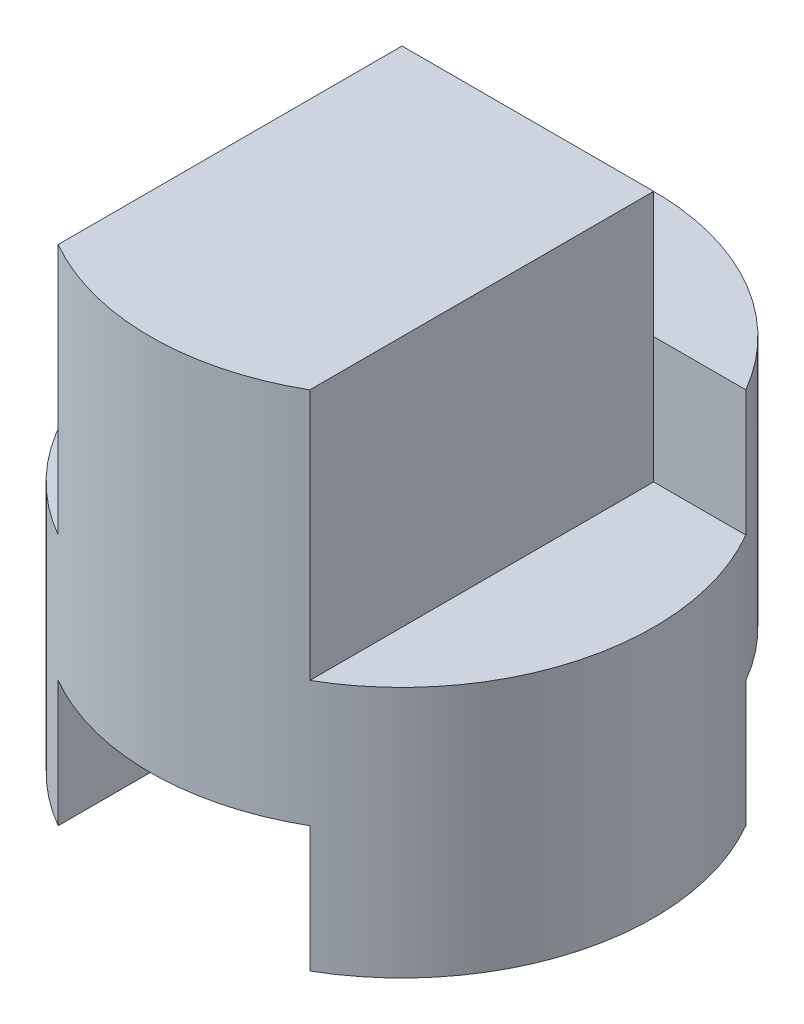
ISO-10303-21;
HEADER;
FILE_DESCRIPTION(('STEP AP214'),'2;1');
FILE_NAME('part.step','',(''),(''),'','','');
FILE_SCHEMA(('AUTOMOTIVE_DESIGN { 1 0 10303 214 1 1 1 1 }'));
ENDSEC;
DATA;
#1=APPLICATION_CONTEXT('core data for automotive mechanical design processes');
#2=APPLICATION_PROTOCOL_DEFINITION('international standard','automotive_design',2000,#1);
#3=PRODUCT_CONTEXT('',#1,'mechanical');
#4=PRODUCT('Part','Part','',(#3));
#5=PRODUCT_RELATED_PRODUCT_CATEGORY('part','',(#4));
#6=PRODUCT_DEFINITION_FORMATION('','',#4);
#7=PRODUCT_DEFINITION_CONTEXT('part definition',#1,'design');
#8=PRODUCT_DEFINITION('design','',#6,#7);
#9=PRODUCT_DEFINITION_SHAPE('','',#8);
#10=(LENGTH_UNIT() NAMED_UNIT(*) SI_UNIT(.MILLI.,.METRE.));
#11=(NAMED_UNIT(*) PLANE_ANGLE_UNIT() SI_UNIT($,.RADIAN.));
#12=(NAMED_UNIT(*) SI_UNIT($,.STERADIAN.) SOLID_ANGLE_UNIT());
#13=UNCERTAINTY_MEASURE_WITH_UNIT(LENGTH_MEASURE(1.E-05),#10,'distance_accuracy_value','');
#14=(GEOMETRIC_REPRESENTATION_CONTEXT(3) GLOBAL_UNCERTAINTY_ASSIGNED_CONTEXT((#13)) GLOBAL_UNIT_ASSIGNED_CONTEXT((#10,
#11,#12)) REPRESENTATION_CONTEXT('',''));
#15=CARTESIAN_POINT('',(0.,0.,0.));
#16=DIRECTION('',(0.,0.,1.));
#17=DIRECTION('',(1.,0.,0.));
#18=AXIS2_PLACEMENT_3D('',#15,#16,#17);
#19=CARTESIAN_POINT('',(0.,4.,0.));
#20=DIRECTION('',(0.,-1.,0.));
#21=DIRECTION('',(0.,0.,-1.));
#22=AXIS2_PLACEMENT_3D('',#19,#20,#21);
#23=CYLINDRICAL_SURFACE('',#22,2.);
#24=CARTESIAN_POINT('',(0.,0.,0.));
#25=DIRECTION('',(0.,1.,0.));
#26=DIRECTION('',(0.,0.,1.));
#27=AXIS2_PLACEMENT_3D('',#24,#25,#26);
#28=CIRCLE('',#27,2.);
#29=CARTESIAN_POINT('',(1.,0.,1.73205080756888));
#30=VERTEX_POINT('',#29);
#31=CARTESIAN_POINT('',(1.73205080756888,0.,-1.));
#32=VERTEX_POINT('',#31);
#33=EDGE_CURVE('E147',#30,#32,#28,.T.);
#34=ORIENTED_EDGE('',*,*,#33,.T.);
#35=DIRECTION('',(0.,-1.,0.));
#36=VECTOR('',#35,1.);
#37=CARTESIAN_POINT('',(1.73205080756888,1.,-1.));
#38=LINE('',#37,#36);
#39=CARTESIAN_POINT('',(1.73205080756888,1.,-1.));
#40=VERTEX_POINT('',#39);
#41=EDGE_CURVE('E139',#40,#32,#38,.T.);
#42=ORIENTED_EDGE('',*,*,#41,.F.);
#43=CARTESIAN_POINT('',(0.,1.,0.));
#44=DIRECTION('',(0.,1.,0.));
#45=DIRECTION('',(-1.,0.,0.));
#46=AXIS2_PLACEMENT_3D('',#43,#44,#45);
#47=CIRCLE('',#46,2.);
#48=CARTESIAN_POINT('',(-1.73205080756888,1.,-1.));
#49=VERTEX_POINT('',#48);
#50=EDGE_CURVE('E126',#40,#49,#47,.T.);
#51=ORIENTED_EDGE('',*,*,#50,.T.);
#52=DIRECTION('',(0.,-1.,0.));
#53=VECTOR('',#52,1.);
#54=CARTESIAN_POINT('',(-1.73205080756888,1.,-1.));
#55=LINE('',#54,#53);
#56=CARTESIAN_POINT('',(-1.73205080756888,0.,-1.));
#57=VERTEX_POINT('',#56);
#58=EDGE_CURVE('E148',#49,#57,#55,.T.);
#59=ORIENTED_EDGE('',*,*,#58,.T.);
#60=CARTESIAN_POINT('',(-1.,0.,1.73205080756888));
#61=VERTEX_POINT('',#60);
#62=EDGE_CURVE('E200',#57,#61,#28,.T.);
#63=ORIENTED_EDGE('',*,*,#62,.T.);
#64=DIRECTION('',(0.,-1.,0.));
#65=VECTOR('',#64,1.);
#66=CARTESIAN_POINT('',(-1.,4.,1.73205080756888));
#67=LINE('',#66,#65);
#68=CARTESIAN_POINT('',(-1.,1.,1.73205080756888));
#69=VERTEX_POINT('',#68);
#70=EDGE_CURVE('E197',#61,#69,#67,.F.);
#71=ORIENTED_EDGE('',*,*,#70,.T.);
#72=CARTESIAN_POINT('',(1.,1.,1.73205080756888));
#73=VERTEX_POINT('',#72);
#74=EDGE_CURVE('E135',#69,#73,#47,.T.);
#75=ORIENTED_EDGE('',*,*,#74,.T.);
#76=DIRECTION('',(0.,-1.,0.));
#77=VECTOR('',#76,1.);
#78=CARTESIAN_POINT('',(1.,4.,1.73205080756888));
#79=LINE('',#78,#77);
#80=EDGE_CURVE('E194',#73,#30,#79,.T.);
#81=ORIENTED_EDGE('',*,*,#80,.T.);
#82=EDGE_LOOP('',(#34,#42,#51,#59,#63,#71,#75,#81));
#83=FACE_BOUND('',#82,.T.);
#84=DIRECTION('',(0.,-1.,0.));
#85=VECTOR('',#84,1.);
#86=CARTESIAN_POINT('',(-1.73205080756888,4.,-1.));
#87=LINE('',#86,#85);
#88=CARTESIAN_POINT('',(-1.73205080756888,2.,-1.));
#89=VERTEX_POINT('',#88);
#90=CARTESIAN_POINT('',(-1.73205080756888,3.,-1.));
#91=VERTEX_POINT('',#90);
#92=EDGE_CURVE('E186',#89,#91,#87,.F.);
#93=ORIENTED_EDGE('',*,*,#92,.T.);
#94=CARTESIAN_POINT('',(0.,3.,0.));
#95=DIRECTION('',(0.,1.,0.));
#96=DIRECTION('',(0.,0.,-1.));
#97=AXIS2_PLACEMENT_3D('',#94,#95,#96);
#98=CIRCLE('',#97,2.);
#99=CARTESIAN_POINT('',(1.73205080756888,3.,-1.));
#100=VERTEX_POINT('',#99);
#101=EDGE_CURVE('E55',#100,#91,#98,.T.);
#102=ORIENTED_EDGE('',*,*,#101,.F.);
#103=DIRECTION('',(0.,-1.,0.));
#104=VECTOR('',#103,1.);
#105=CARTESIAN_POINT('',(1.73205080756888,4.,-1.));
#106=LINE('',#105,#104);
#107=CARTESIAN_POINT('',(1.73205080756888,2.,-1.));
#108=VERTEX_POINT('',#107);
#109=EDGE_CURVE('E174',#100,#108,#106,.T.);
#110=ORIENTED_EDGE('',*,*,#109,.T.);
#111=CARTESIAN_POINT('',(0.,2.,0.));
#112=DIRECTION('',(0.,1.,0.));
#113=DIRECTION('',(-1.,0.,0.));
#114=AXIS2_PLACEMENT_3D('',#111,#112,#113);
#115=CIRCLE('',#114,2.);
#116=CARTESIAN_POINT('',(0.999776138398955,2.,1.73218003483705));
#117=VERTEX_POINT('',#116);
#118=EDGE_CURVE('E217',#117,#108,#115,.T.);
#119=ORIENTED_EDGE('',*,*,#118,.F.);
#120=DIRECTION('',(0.,-1.,0.));
#121=VECTOR('',#120,1.);
#122=CARTESIAN_POINT('',(0.999776138398955,4.,1.73218003483705));
#123=LINE('',#122,#121);
#124=CARTESIAN_POINT('',(0.999776138398955,4.,1.73218003483705));
#125=VERTEX_POINT('',#124);
#126=EDGE_CURVE('E183',#125,#117,#123,.T.);
#127=ORIENTED_EDGE('',*,*,#126,.F.);
#128=CARTESIAN_POINT('',(0.,4.,0.));
#129=DIRECTION('',(0.,1.,0.));
#130=DIRECTION('',(0.,0.,1.));
#131=AXIS2_PLACEMENT_3D('',#128,#129,#130);
#132=CIRCLE('',#131,2.);
#133=CARTESIAN_POINT('',(-1.,4.,1.73205080756888));
#134=VERTEX_POINT('',#133);
#135=EDGE_CURVE('E201',#134,#125,#132,.T.);
#136=ORIENTED_EDGE('',*,*,#135,.F.);
#137=DIRECTION('',(0.,-1.,0.));
#138=VECTOR('',#137,1.);
#139=CARTESIAN_POINT('',(-1.,4.,1.73205080756888));
#140=LINE('',#139,#138);
#141=CARTESIAN_POINT('',(-1.,2.,1.73205080756888));
#142=VERTEX_POINT('',#141);
#143=EDGE_CURVE('E189',#142,#134,#140,.F.);
#144=ORIENTED_EDGE('',*,*,#143,.F.);
#145=CARTESIAN_POINT('',(0.,2.,0.));
#146=DIRECTION('',(0.,1.,0.));
#147=DIRECTION('',(-1.,0.,0.));
#148=AXIS2_PLACEMENT_3D('',#145,#146,#147);
#149=CIRCLE('',#148,2.);
#150=EDGE_CURVE('E40',#89,#142,#149,.T.);
#151=ORIENTED_EDGE('',*,*,#150,.F.);
#152=EDGE_LOOP('',(#93,#102,#110,#119,#127,#136,#144,#151));
#153=FACE_BOUND('',#152,.T.);
#154=ADVANCED_FACE('F33',(#83,#153),#23,.T.);
#155=CARTESIAN_POINT('',(0.,4.,0.));
#156=DIRECTION('',(0.,1.,0.));
#157=DIRECTION('',(0.,0.,1.));
#158=AXIS2_PLACEMENT_3D('',#155,#156,#157);
#159=PLANE('',#158);
#160=DIRECTION('',(1.,0.,0.));
#161=VECTOR('',#160,1.);
#162=CARTESIAN_POINT('',(-1.73205080756888,4.,-1.));
#163=LINE('',#162,#161);
#164=CARTESIAN_POINT('',(-1.,4.,-1.));
#165=VERTEX_POINT('',#164);
#166=CARTESIAN_POINT('',(0.999776138398954,4.,-1.));
#167=VERTEX_POINT('',#166);
#168=EDGE_CURVE('E156',#165,#167,#163,.T.);
#169=ORIENTED_EDGE('',*,*,#168,.F.);
#170=DIRECTION('',(0.,0.,1.));
#171=VECTOR('',#170,1.);
#172=CARTESIAN_POINT('',(-1.,4.,0.));
#173=LINE('',#172,#171);
#174=EDGE_CURVE('E214',#165,#134,#173,.T.);
#175=ORIENTED_EDGE('',*,*,#174,.T.);
#176=ORIENTED_EDGE('',*,*,#135,.T.);
#177=DIRECTION('',(0.,0.,-1.));
#178=VECTOR('',#177,1.);
#179=CARTESIAN_POINT('',(0.999776138398955,4.,0.));
#180=LINE('',#179,#178);
#181=EDGE_CURVE('E134',#125,#167,#180,.T.);
#182=ORIENTED_EDGE('',*,*,#181,.T.);
#183=EDGE_LOOP('',(#169,#175,#176,#182));
#184=FACE_BOUND('',#183,.T.);
#185=ADVANCED_FACE('F234',(#184),#159,.T.);
#186=CARTESIAN_POINT('',(0.,0.,0.));
#187=DIRECTION('',(0.,1.,0.));
#188=DIRECTION('',(0.,0.,1.));
#189=AXIS2_PLACEMENT_3D('',#186,#187,#188);
#190=PLANE('',#189);
#191=ORIENTED_EDGE('',*,*,#62,.F.);
#192=DIRECTION('',(-1.,0.,0.));
#193=VECTOR('',#192,1.);
#194=CARTESIAN_POINT('',(-1.73205080756888,0.,-1.));
#195=LINE('',#194,#193);
#196=CARTESIAN_POINT('',(-1.,0.,-1.));
#197=VERTEX_POINT('',#196);
#198=EDGE_CURVE('E292',#197,#57,#195,.T.);
#199=ORIENTED_EDGE('',*,*,#198,.F.);
#200=DIRECTION('',(0.,0.,1.));
#201=VECTOR('',#200,1.);
#202=CARTESIAN_POINT('',(-1.,0.,0.));
#203=LINE('',#202,#201);
#204=EDGE_CURVE('E208',#197,#61,#203,.T.);
#205=ORIENTED_EDGE('',*,*,#204,.T.);
#206=EDGE_LOOP('',(#191,#199,#205));
#207=FACE_BOUND('',#206,.T.);
#208=ADVANCED_FACE('F266',(#207),#190,.F.);
#209=DIRECTION('',(0.,0.,-1.));
#210=VECTOR('',#209,1.);
#211=CARTESIAN_POINT('',(1.,0.,0.));
#212=LINE('',#211,#210);
#213=CARTESIAN_POINT('',(0.999999999999999,0.,-1.));
#214=VERTEX_POINT('',#213);
#215=EDGE_CURVE('E204',#30,#214,#212,.T.);
#216=ORIENTED_EDGE('',*,*,#215,.T.);
#217=EDGE_CURVE('E282',#32,#214,#195,.T.);
#218=ORIENTED_EDGE('',*,*,#217,.F.);
#219=ORIENTED_EDGE('',*,*,#33,.F.);
#220=EDGE_LOOP('',(#216,#218,#219));
#221=FACE_BOUND('',#220,.T.);
#222=ADVANCED_FACE('F271',(#221),#190,.F.);
#223=CARTESIAN_POINT('',(-1.,1.,-2.));
#224=DIRECTION('',(0.,1.,0.));
#225=DIRECTION('',(-1.,0.,0.));
#226=AXIS2_PLACEMENT_3D('',#223,#224,#225);
#227=PLANE('',#226);
#228=DIRECTION('',(0.,0.,1.));
#229=VECTOR('',#228,1.);
#230=CARTESIAN_POINT('',(-1.,1.,-2.));
#231=LINE('',#230,#229);
#232=CARTESIAN_POINT('',(-1.,1.,-1.));
#233=VERTEX_POINT('',#232);
#234=EDGE_CURVE('E192',#233,#69,#231,.T.);
#235=ORIENTED_EDGE('',*,*,#234,.F.);
#236=DIRECTION('',(-1.,0.,0.));
#237=VECTOR('',#236,1.);
#238=CARTESIAN_POINT('',(-1.73205080756888,1.,-1.));
#239=LINE('',#238,#237);
#240=EDGE_CURVE('E129',#233,#49,#239,.T.);
#241=ORIENTED_EDGE('',*,*,#240,.T.);
#242=ORIENTED_EDGE('',*,*,#50,.F.);
#243=CARTESIAN_POINT('',(1.,1.,-1.));
#244=VERTEX_POINT('',#243);
#245=EDGE_CURVE('E47',#40,#244,#239,.T.);
#246=ORIENTED_EDGE('',*,*,#245,.T.);
#247=DIRECTION('',(0.,0.,1.));
#248=VECTOR('',#247,1.);
#249=CARTESIAN_POINT('',(1.,1.,-2.));
#250=LINE('',#249,#248);
#251=EDGE_CURVE('E191',#244,#73,#250,.T.);
#252=ORIENTED_EDGE('',*,*,#251,.T.);
#253=ORIENTED_EDGE('',*,*,#74,.F.);
#254=EDGE_LOOP('',(#235,#241,#242,#246,#252,#253));
#255=FACE_BOUND('',#254,.T.);
#256=ADVANCED_FACE('F128',(#255),#227,.F.);
#257=CARTESIAN_POINT('',(-1.,0.,-2.));
#258=DIRECTION('',(-1.,0.,0.));
#259=DIRECTION('',(0.,0.,1.));
#260=AXIS2_PLACEMENT_3D('',#257,#258,#259);
#261=PLANE('',#260);
#262=ORIENTED_EDGE('',*,*,#204,.F.);
#263=DIRECTION('',(0.,1.,0.));
#264=VECTOR('',#263,1.);
#265=CARTESIAN_POINT('',(-1.,0.,-1.));
#266=LINE('',#265,#264);
#267=EDGE_CURVE('E150',#197,#233,#266,.T.);
#268=ORIENTED_EDGE('',*,*,#267,.T.);
#269=ORIENTED_EDGE('',*,*,#234,.T.);
#270=ORIENTED_EDGE('',*,*,#70,.F.);
#271=EDGE_LOOP('',(#262,#268,#269,#270));
#272=FACE_BOUND('',#271,.T.);
#273=ADVANCED_FACE('F274',(#272),#261,.F.);
#274=CARTESIAN_POINT('',(1.,0.,-2.));
#275=DIRECTION('',(1.,0.,0.));
#276=DIRECTION('',(0.,0.,-1.));
#277=AXIS2_PLACEMENT_3D('',#274,#275,#276);
#278=PLANE('',#277);
#279=ORIENTED_EDGE('',*,*,#251,.F.);
#280=DIRECTION('',(0.,-1.,0.));
#281=VECTOR('',#280,1.);
#282=CARTESIAN_POINT('',(1.,0.,-1.));
#283=LINE('',#282,#281);
#284=EDGE_CURVE('E11',#244,#214,#283,.T.);
#285=ORIENTED_EDGE('',*,*,#284,.T.);
#286=ORIENTED_EDGE('',*,*,#215,.F.);
#287=ORIENTED_EDGE('',*,*,#80,.F.);
#288=EDGE_LOOP('',(#279,#285,#286,#287));
#289=FACE_BOUND('',#288,.T.);
#290=ADVANCED_FACE('F285',(#289),#278,.F.);
#291=CARTESIAN_POINT('',(0.999776138398955,2.,4.));
#292=DIRECTION('',(0.,1.,0.));
#293=DIRECTION('',(-1.,0.,0.));
#294=AXIS2_PLACEMENT_3D('',#291,#292,#293);
#295=PLANE('',#294);
#296=DIRECTION('',(0.,0.,-1.));
#297=VECTOR('',#296,1.);
#298=CARTESIAN_POINT('',(0.999776138398955,2.,4.));
#299=LINE('',#298,#297);
#300=CARTESIAN_POINT('',(0.999776138398955,2.,-1.));
#301=VERTEX_POINT('',#300);
#302=EDGE_CURVE('E168',#117,#301,#299,.T.);
#303=ORIENTED_EDGE('',*,*,#302,.F.);
#304=ORIENTED_EDGE('',*,*,#118,.T.);
#305=DIRECTION('',(1.,0.,0.));
#306=VECTOR('',#305,1.);
#307=CARTESIAN_POINT('',(0.999776138398955,2.,-1.));
#308=LINE('',#307,#306);
#309=EDGE_CURVE('E177',#301,#108,#308,.T.);
#310=ORIENTED_EDGE('',*,*,#309,.F.);
#311=EDGE_LOOP('',(#303,#304,#310));
#312=FACE_BOUND('',#311,.T.);
#313=ADVANCED_FACE('F246',(#312),#295,.T.);
#314=CARTESIAN_POINT('',(0.999776138398955,3.,4.));
#315=DIRECTION('',(1.,0.,0.));
#316=DIRECTION('',(0.,0.,-1.));
#317=AXIS2_PLACEMENT_3D('',#314,#315,#316);
#318=PLANE('',#317);
#319=ORIENTED_EDGE('',*,*,#126,.T.);
#320=ORIENTED_EDGE('',*,*,#302,.T.);
#321=DIRECTION('',(0.,-1.,0.));
#322=VECTOR('',#321,1.);
#323=CARTESIAN_POINT('',(0.999776138398955,3.,-1.));
#324=LINE('',#323,#322);
#325=CARTESIAN_POINT('',(0.999776138398954,3.,-1.));
#326=VERTEX_POINT('',#325);
#327=EDGE_CURVE('E161',#326,#301,#324,.T.);
#328=ORIENTED_EDGE('',*,*,#327,.F.);
#329=EDGE_CURVE('E175',#167,#326,#324,.T.);
#330=ORIENTED_EDGE('',*,*,#329,.F.);
#331=ORIENTED_EDGE('',*,*,#181,.F.);
#332=EDGE_LOOP('',(#319,#320,#328,#330,#331));
#333=FACE_BOUND('',#332,.T.);
#334=ADVANCED_FACE('F248',(#333),#318,.T.);
#335=CARTESIAN_POINT('',(0.,0.,-1.));
#336=DIRECTION('',(0.,0.,-1.));
#337=DIRECTION('',(-1.,0.,0.));
#338=AXIS2_PLACEMENT_3D('',#335,#336,#337);
#339=PLANE('',#338);
#340=ORIENTED_EDGE('',*,*,#109,.F.);
#341=DIRECTION('',(1.,0.,0.));
#342=VECTOR('',#341,1.);
#343=CARTESIAN_POINT('',(-1.73205080756888,3.,-1.));
#344=LINE('',#343,#342);
#345=EDGE_CURVE('E158',#326,#100,#344,.T.);
#346=ORIENTED_EDGE('',*,*,#345,.F.);
#347=ORIENTED_EDGE('',*,*,#327,.T.);
#348=ORIENTED_EDGE('',*,*,#309,.T.);
#349=EDGE_LOOP('',(#340,#346,#347,#348));
#350=FACE_BOUND('',#349,.T.);
#351=ADVANCED_FACE('F241',(#350),#339,.F.);
#352=CARTESIAN_POINT('',(-1.,2.,4.));
#353=DIRECTION('',(0.,1.,0.));
#354=DIRECTION('',(-1.,0.,0.));
#355=AXIS2_PLACEMENT_3D('',#352,#353,#354);
#356=PLANE('',#355);
#357=ORIENTED_EDGE('',*,*,#150,.T.);
#358=DIRECTION('',(0.,0.,-1.));
#359=VECTOR('',#358,1.);
#360=CARTESIAN_POINT('',(-1.,2.,4.));
#361=LINE('',#360,#359);
#362=CARTESIAN_POINT('',(-1.,2.,-1.));
#363=VERTEX_POINT('',#362);
#364=EDGE_CURVE('E172',#142,#363,#361,.T.);
#365=ORIENTED_EDGE('',*,*,#364,.T.);
#366=DIRECTION('',(1.,0.,0.));
#367=VECTOR('',#366,1.);
#368=CARTESIAN_POINT('',(-1.,2.,-1.));
#369=LINE('',#368,#367);
#370=EDGE_CURVE('E164',#89,#363,#369,.T.);
#371=ORIENTED_EDGE('',*,*,#370,.F.);
#372=EDGE_LOOP('',(#357,#365,#371));
#373=FACE_BOUND('',#372,.T.);
#374=ADVANCED_FACE('F223',(#373),#356,.T.);
#375=CARTESIAN_POINT('',(-1.,3.,4.));
#376=DIRECTION('',(-1.,0.,0.));
#377=DIRECTION('',(0.,0.,1.));
#378=AXIS2_PLACEMENT_3D('',#375,#376,#377);
#379=PLANE('',#378);
#380=ORIENTED_EDGE('',*,*,#143,.T.);
#381=ORIENTED_EDGE('',*,*,#174,.F.);
#382=DIRECTION('',(0.,1.,0.));
#383=VECTOR('',#382,1.);
#384=CARTESIAN_POINT('',(-1.,2.,-1.));
#385=LINE('',#384,#383);
#386=CARTESIAN_POINT('',(-1.,3.,-1.));
#387=VERTEX_POINT('',#386);
#388=EDGE_CURVE('E167',#387,#165,#385,.T.);
#389=ORIENTED_EDGE('',*,*,#388,.F.);
#390=EDGE_CURVE('E169',#363,#387,#385,.T.);
#391=ORIENTED_EDGE('',*,*,#390,.F.);
#392=ORIENTED_EDGE('',*,*,#364,.F.);
#393=EDGE_LOOP('',(#380,#381,#389,#391,#392));
#394=FACE_BOUND('',#393,.T.);
#395=ADVANCED_FACE('F227',(#394),#379,.T.);
#396=CARTESIAN_POINT('',(0.,0.,-1.));
#397=DIRECTION('',(0.,0.,-1.));
#398=DIRECTION('',(-1.,0.,0.));
#399=AXIS2_PLACEMENT_3D('',#396,#397,#398);
#400=PLANE('',#399);
#401=ORIENTED_EDGE('',*,*,#390,.T.);
#402=EDGE_CURVE('E159',#91,#387,#344,.T.);
#403=ORIENTED_EDGE('',*,*,#402,.F.);
#404=ORIENTED_EDGE('',*,*,#92,.F.);
#405=ORIENTED_EDGE('',*,*,#370,.T.);
#406=EDGE_LOOP('',(#401,#403,#404,#405));
#407=FACE_BOUND('',#406,.T.);
#408=ADVANCED_FACE('F237',(#407),#400,.F.);
#409=CARTESIAN_POINT('',(-1.73205080756888,3.,-1.));
#410=DIRECTION('',(0.,0.,1.));
#411=DIRECTION('',(1.,0.,0.));
#412=AXIS2_PLACEMENT_3D('',#409,#410,#411);
#413=PLANE('',#412);
#414=ORIENTED_EDGE('',*,*,#329,.T.);
#415=EDGE_CURVE('E162',#387,#326,#344,.T.);
#416=ORIENTED_EDGE('',*,*,#415,.F.);
#417=ORIENTED_EDGE('',*,*,#388,.T.);
#418=ORIENTED_EDGE('',*,*,#168,.T.);
#419=EDGE_LOOP('',(#414,#416,#417,#418));
#420=FACE_BOUND('',#419,.T.);
#421=ADVANCED_FACE('F251',(#420),#413,.F.);
#422=CARTESIAN_POINT('',(0.,3.,0.));
#423=DIRECTION('',(0.,-1.,0.));
#424=DIRECTION('',(0.,0.,-1.));
#425=AXIS2_PLACEMENT_3D('',#422,#423,#424);
#426=PLANE('',#425);
#427=ORIENTED_EDGE('',*,*,#101,.T.);
#428=ORIENTED_EDGE('',*,*,#402,.T.);
#429=ORIENTED_EDGE('',*,*,#415,.T.);
#430=ORIENTED_EDGE('',*,*,#345,.T.);
#431=EDGE_LOOP('',(#427,#428,#429,#430));
#432=FACE_BOUND('',#431,.T.);
#433=ADVANCED_FACE('F252',(#432),#426,.F.);
#434=CARTESIAN_POINT('',(-1.73205080756888,1.,-1.));
#435=DIRECTION('',(0.,0.,1.));
#436=DIRECTION('',(1.,0.,0.));
#437=AXIS2_PLACEMENT_3D('',#434,#435,#436);
#438=PLANE('',#437);
#439=ORIENTED_EDGE('',*,*,#245,.F.);
#440=ORIENTED_EDGE('',*,*,#41,.T.);
#441=ORIENTED_EDGE('',*,*,#217,.T.);
#442=ORIENTED_EDGE('',*,*,#284,.F.);
#443=EDGE_LOOP('',(#439,#440,#441,#442));
#444=FACE_BOUND('',#443,.T.);
#445=ADVANCED_FACE('F138',(#444),#438,.F.);
#446=ORIENTED_EDGE('',*,*,#198,.T.);
#447=ORIENTED_EDGE('',*,*,#58,.F.);
#448=ORIENTED_EDGE('',*,*,#240,.F.);
#449=ORIENTED_EDGE('',*,*,#267,.F.);
#450=EDGE_LOOP('',(#446,#447,#448,#449));
#451=FACE_BOUND('',#450,.T.);
#452=ADVANCED_FACE('F259',(#451),#438,.F.);
#453=CLOSED_SHELL('',(#154,#185,#208,#222,#256,#273,#290,#313,#334,#351,#374,#395,#408,#421,
#433,#445,#452));
#454=MANIFOLD_SOLID_BREP('B2',#453);
#455=ADVANCED_BREP_SHAPE_REPRESENTATION('',(#18,#454),#14);
#456=SHAPE_DEFINITION_REPRESENTATION(#9,#455);
ENDSEC;
END-ISO-10303-21;
